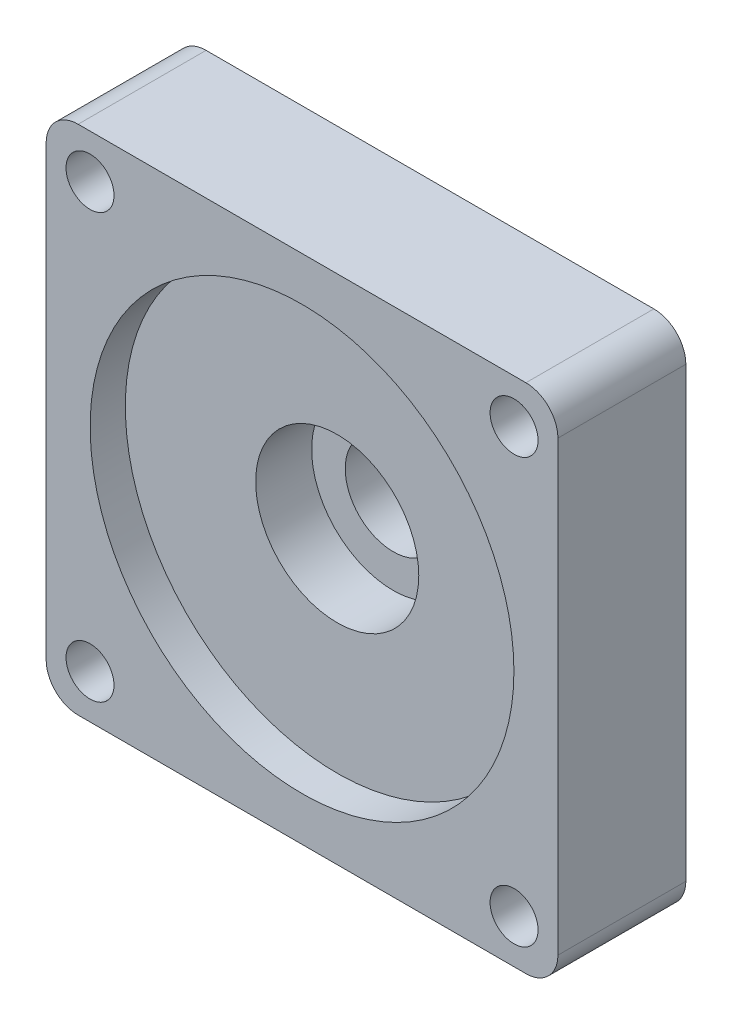
ISO-10303-21;
HEADER;
FILE_DESCRIPTION(('STEP AP214'),'2;1');
FILE_NAME('part.step','',(''),(''),'','','');
FILE_SCHEMA(('AUTOMOTIVE_DESIGN { 1 0 10303 214 1 1 1 1 }'));
ENDSEC;
DATA;
#1=APPLICATION_CONTEXT('core data for automotive mechanical design processes');
#2=APPLICATION_PROTOCOL_DEFINITION('international standard','automotive_design',2000,#1);
#3=PRODUCT_CONTEXT('',#1,'mechanical');
#4=PRODUCT('Part','Part','',(#3));
#5=PRODUCT_RELATED_PRODUCT_CATEGORY('part','',(#4));
#6=PRODUCT_DEFINITION_FORMATION('','',#4);
#7=PRODUCT_DEFINITION_CONTEXT('part definition',#1,'design');
#8=PRODUCT_DEFINITION('design','',#6,#7);
#9=PRODUCT_DEFINITION_SHAPE('','',#8);
#10=(LENGTH_UNIT() NAMED_UNIT(*) SI_UNIT(.MILLI.,.METRE.));
#11=(NAMED_UNIT(*) PLANE_ANGLE_UNIT() SI_UNIT($,.RADIAN.));
#12=(NAMED_UNIT(*) SI_UNIT($,.STERADIAN.) SOLID_ANGLE_UNIT());
#13=UNCERTAINTY_MEASURE_WITH_UNIT(LENGTH_MEASURE(1.E-05),#10,'distance_accuracy_value','');
#14=(GEOMETRIC_REPRESENTATION_CONTEXT(3) GLOBAL_UNCERTAINTY_ASSIGNED_CONTEXT((#13)) GLOBAL_UNIT_ASSIGNED_CONTEXT((#10,
#11,#12)) REPRESENTATION_CONTEXT('',''));
#15=CARTESIAN_POINT('',(0.,0.,0.));
#16=DIRECTION('',(0.,0.,1.));
#17=DIRECTION('',(1.,0.,0.));
#18=AXIS2_PLACEMENT_3D('',#15,#16,#17);
#19=CARTESIAN_POINT('',(16.,16.,8.));
#20=DIRECTION('',(-1.,0.,0.));
#21=DIRECTION('',(0.,0.,1.));
#22=AXIS2_PLACEMENT_3D('',#19,#20,#21);
#23=PLANE('',#22);
#24=DIRECTION('',(0.,1.,0.));
#25=VECTOR('',#24,1.);
#26=CARTESIAN_POINT('',(16.,16.,0.));
#27=LINE('',#26,#25);
#28=CARTESIAN_POINT('',(16.,-14.,0.));
#29=VERTEX_POINT('',#28);
#30=CARTESIAN_POINT('',(16.,14.,0.));
#31=VERTEX_POINT('',#30);
#32=EDGE_CURVE('E165',#29,#31,#27,.T.);
#33=ORIENTED_EDGE('',*,*,#32,.T.);
#34=DIRECTION('',(0.,0.,-1.));
#35=VECTOR('',#34,1.);
#36=CARTESIAN_POINT('',(16.,14.,8.));
#37=LINE('',#36,#35);
#38=CARTESIAN_POINT('',(16.,14.,8.));
#39=VERTEX_POINT('',#38);
#40=EDGE_CURVE('E11',#31,#39,#37,.F.);
#41=ORIENTED_EDGE('',*,*,#40,.T.);
#42=DIRECTION('',(0.,1.,0.));
#43=VECTOR('',#42,1.);
#44=CARTESIAN_POINT('',(16.,16.,8.));
#45=LINE('',#44,#43);
#46=CARTESIAN_POINT('',(16.,-14.,8.));
#47=VERTEX_POINT('',#46);
#48=EDGE_CURVE('E133',#47,#39,#45,.T.);
#49=ORIENTED_EDGE('',*,*,#48,.F.);
#50=DIRECTION('',(0.,0.,-1.));
#51=VECTOR('',#50,1.);
#52=CARTESIAN_POINT('',(16.,-14.,8.));
#53=LINE('',#52,#51);
#54=EDGE_CURVE('E49',#47,#29,#53,.T.);
#55=ORIENTED_EDGE('',*,*,#54,.T.);
#56=EDGE_LOOP('',(#33,#41,#49,#55));
#57=FACE_BOUND('',#56,.T.);
#58=ADVANCED_FACE('F41',(#57),#23,.F.);
#59=CARTESIAN_POINT('',(-16.,16.,8.));
#60=DIRECTION('',(0.,-1.,0.));
#61=DIRECTION('',(0.,0.,-1.));
#62=AXIS2_PLACEMENT_3D('',#59,#60,#61);
#63=PLANE('',#62);
#64=DIRECTION('',(-1.,0.,0.));
#65=VECTOR('',#64,1.);
#66=CARTESIAN_POINT('',(-16.,16.,0.));
#67=LINE('',#66,#65);
#68=CARTESIAN_POINT('',(14.,16.,0.));
#69=VERTEX_POINT('',#68);
#70=CARTESIAN_POINT('',(-14.,16.,0.));
#71=VERTEX_POINT('',#70);
#72=EDGE_CURVE('E138',#69,#71,#67,.T.);
#73=ORIENTED_EDGE('',*,*,#72,.T.);
#74=DIRECTION('',(0.,0.,-1.));
#75=VECTOR('',#74,1.);
#76=CARTESIAN_POINT('',(-14.,16.,8.));
#77=LINE('',#76,#75);
#78=CARTESIAN_POINT('',(-14.,16.,8.));
#79=VERTEX_POINT('',#78);
#80=EDGE_CURVE('E56',#71,#79,#77,.F.);
#81=ORIENTED_EDGE('',*,*,#80,.T.);
#82=DIRECTION('',(-1.,0.,0.));
#83=VECTOR('',#82,1.);
#84=CARTESIAN_POINT('',(-16.,16.,8.));
#85=LINE('',#84,#83);
#86=CARTESIAN_POINT('',(14.,16.,8.));
#87=VERTEX_POINT('',#86);
#88=EDGE_CURVE('E136',#87,#79,#85,.T.);
#89=ORIENTED_EDGE('',*,*,#88,.F.);
#90=DIRECTION('',(0.,0.,-1.));
#91=VECTOR('',#90,1.);
#92=CARTESIAN_POINT('',(14.,16.,8.));
#93=LINE('',#92,#91);
#94=EDGE_CURVE('E157',#87,#69,#93,.T.);
#95=ORIENTED_EDGE('',*,*,#94,.T.);
#96=EDGE_LOOP('',(#73,#81,#89,#95));
#97=FACE_BOUND('',#96,.T.);
#98=ADVANCED_FACE('F266',(#97),#63,.F.);
#99=CARTESIAN_POINT('',(-16.,16.,8.));
#100=DIRECTION('',(1.,0.,0.));
#101=DIRECTION('',(0.,0.,-1.));
#102=AXIS2_PLACEMENT_3D('',#99,#100,#101);
#103=PLANE('',#102);
#104=DIRECTION('',(0.,-1.,0.));
#105=VECTOR('',#104,1.);
#106=CARTESIAN_POINT('',(-16.,16.,0.));
#107=LINE('',#106,#105);
#108=CARTESIAN_POINT('',(-16.,14.,0.));
#109=VERTEX_POINT('',#108);
#110=CARTESIAN_POINT('',(-16.,-14.,0.));
#111=VERTEX_POINT('',#110);
#112=EDGE_CURVE('E134',#109,#111,#107,.T.);
#113=ORIENTED_EDGE('',*,*,#112,.T.);
#114=DIRECTION('',(0.,0.,-1.));
#115=VECTOR('',#114,1.);
#116=CARTESIAN_POINT('',(-16.,-14.,8.));
#117=LINE('',#116,#115);
#118=CARTESIAN_POINT('',(-16.,-14.,8.));
#119=VERTEX_POINT('',#118);
#120=EDGE_CURVE('E112',#111,#119,#117,.F.);
#121=ORIENTED_EDGE('',*,*,#120,.T.);
#122=DIRECTION('',(0.,-1.,0.));
#123=VECTOR('',#122,1.);
#124=CARTESIAN_POINT('',(-16.,16.,8.));
#125=LINE('',#124,#123);
#126=CARTESIAN_POINT('',(-16.,14.,8.));
#127=VERTEX_POINT('',#126);
#128=EDGE_CURVE('E177',#127,#119,#125,.T.);
#129=ORIENTED_EDGE('',*,*,#128,.F.);
#130=DIRECTION('',(0.,0.,-1.));
#131=VECTOR('',#130,1.);
#132=CARTESIAN_POINT('',(-16.,14.,8.));
#133=LINE('',#132,#131);
#134=EDGE_CURVE('E117',#127,#109,#133,.T.);
#135=ORIENTED_EDGE('',*,*,#134,.T.);
#136=EDGE_LOOP('',(#113,#121,#129,#135));
#137=FACE_BOUND('',#136,.T.);
#138=ADVANCED_FACE('F263',(#137),#103,.F.);
#139=CARTESIAN_POINT('',(-16.,-16.,8.));
#140=DIRECTION('',(0.,1.,0.));
#141=DIRECTION('',(0.,0.,1.));
#142=AXIS2_PLACEMENT_3D('',#139,#140,#141);
#143=PLANE('',#142);
#144=DIRECTION('',(1.,0.,0.));
#145=VECTOR('',#144,1.);
#146=CARTESIAN_POINT('',(-16.,-16.,8.));
#147=LINE('',#146,#145);
#148=CARTESIAN_POINT('',(-14.,-16.,8.));
#149=VERTEX_POINT('',#148);
#150=CARTESIAN_POINT('',(14.,-16.,8.));
#151=VERTEX_POINT('',#150);
#152=EDGE_CURVE('E127',#149,#151,#147,.T.);
#153=ORIENTED_EDGE('',*,*,#152,.F.);
#154=DIRECTION('',(0.,0.,-1.));
#155=VECTOR('',#154,1.);
#156=CARTESIAN_POINT('',(-14.,-16.,8.));
#157=LINE('',#156,#155);
#158=CARTESIAN_POINT('',(-14.,-16.,0.));
#159=VERTEX_POINT('',#158);
#160=EDGE_CURVE('E111',#149,#159,#157,.T.);
#161=ORIENTED_EDGE('',*,*,#160,.T.);
#162=DIRECTION('',(1.,0.,0.));
#163=VECTOR('',#162,1.);
#164=CARTESIAN_POINT('',(-16.,-16.,0.));
#165=LINE('',#164,#163);
#166=CARTESIAN_POINT('',(14.,-16.,0.));
#167=VERTEX_POINT('',#166);
#168=EDGE_CURVE('E124',#159,#167,#165,.T.);
#169=ORIENTED_EDGE('',*,*,#168,.T.);
#170=DIRECTION('',(0.,0.,-1.));
#171=VECTOR('',#170,1.);
#172=CARTESIAN_POINT('',(14.,-16.,8.));
#173=LINE('',#172,#171);
#174=EDGE_CURVE('E129',#167,#151,#173,.F.);
#175=ORIENTED_EDGE('',*,*,#174,.T.);
#176=EDGE_LOOP('',(#153,#161,#169,#175));
#177=FACE_BOUND('',#176,.T.);
#178=ADVANCED_FACE('F123',(#177),#143,.F.);
#179=CARTESIAN_POINT('',(0.,0.,8.));
#180=DIRECTION('',(0.,0.,1.));
#181=DIRECTION('',(1.,0.,0.));
#182=AXIS2_PLACEMENT_3D('',#179,#180,#181);
#183=PLANE('',#182);
#184=CARTESIAN_POINT('',(0.,0.,8.));
#185=DIRECTION('',(0.,0.,1.));
#186=DIRECTION('',(1.,0.,0.));
#187=AXIS2_PLACEMENT_3D('',#184,#185,#186);
#188=CIRCLE('',#187,13.25);
#189=CARTESIAN_POINT('',(13.25,0.,8.));
#190=VERTEX_POINT('',#189);
#191=EDGE_CURVE('E202',#190,#190,#188,.T.);
#192=ORIENTED_EDGE('',*,*,#191,.F.);
#193=EDGE_LOOP('',(#192));
#194=FACE_BOUND('',#193,.T.);
#195=CARTESIAN_POINT('',(-13.2582521472478,-13.2582521472478,8.));
#196=DIRECTION('',(0.,0.,1.));
#197=DIRECTION('',(1.,0.,0.));
#198=AXIS2_PLACEMENT_3D('',#195,#196,#197);
#199=CIRCLE('',#198,1.5);
#200=CARTESIAN_POINT('',(-11.7582521472478,-13.2582521472478,8.));
#201=VERTEX_POINT('',#200);
#202=EDGE_CURVE('E184',#201,#201,#199,.T.);
#203=ORIENTED_EDGE('',*,*,#202,.F.);
#204=EDGE_LOOP('',(#203));
#205=FACE_BOUND('',#204,.T.);
#206=CARTESIAN_POINT('',(13.2582521472478,-13.2582521472478,8.));
#207=DIRECTION('',(0.,0.,1.));
#208=DIRECTION('',(1.,0.,0.));
#209=AXIS2_PLACEMENT_3D('',#206,#207,#208);
#210=CIRCLE('',#209,1.5);
#211=CARTESIAN_POINT('',(14.7582521472478,-13.2582521472478,8.));
#212=VERTEX_POINT('',#211);
#213=EDGE_CURVE('E192',#212,#212,#210,.T.);
#214=ORIENTED_EDGE('',*,*,#213,.F.);
#215=EDGE_LOOP('',(#214));
#216=FACE_BOUND('',#215,.T.);
#217=CARTESIAN_POINT('',(13.2582521472478,13.2582521472478,8.));
#218=DIRECTION('',(0.,0.,1.));
#219=DIRECTION('',(1.,0.,0.));
#220=AXIS2_PLACEMENT_3D('',#217,#218,#219);
#221=CIRCLE('',#220,1.5);
#222=CARTESIAN_POINT('',(14.7582521472478,13.2582521472478,8.));
#223=VERTEX_POINT('',#222);
#224=EDGE_CURVE('E183',#223,#223,#221,.T.);
#225=ORIENTED_EDGE('',*,*,#224,.F.);
#226=EDGE_LOOP('',(#225));
#227=FACE_BOUND('',#226,.T.);
#228=CARTESIAN_POINT('',(-13.2582521472478,13.2582521472478,8.));
#229=DIRECTION('',(0.,0.,1.));
#230=DIRECTION('',(1.,0.,0.));
#231=AXIS2_PLACEMENT_3D('',#228,#229,#230);
#232=CIRCLE('',#231,1.5);
#233=CARTESIAN_POINT('',(-11.7582521472478,13.2582521472478,8.));
#234=VERTEX_POINT('',#233);
#235=EDGE_CURVE('E173',#234,#234,#232,.T.);
#236=ORIENTED_EDGE('',*,*,#235,.F.);
#237=EDGE_LOOP('',(#236));
#238=FACE_BOUND('',#237,.T.);
#239=ORIENTED_EDGE('',*,*,#128,.T.);
#240=CARTESIAN_POINT('',(-14.,-14.,8.));
#241=DIRECTION('',(0.,0.,1.));
#242=DIRECTION('',(1.,0.,0.));
#243=AXIS2_PLACEMENT_3D('',#240,#241,#242);
#244=CIRCLE('',#243,2.);
#245=EDGE_CURVE('E155',#119,#149,#244,.T.);
#246=ORIENTED_EDGE('',*,*,#245,.T.);
#247=ORIENTED_EDGE('',*,*,#152,.T.);
#248=CARTESIAN_POINT('',(14.,-14.,8.));
#249=DIRECTION('',(0.,0.,1.));
#250=DIRECTION('',(1.,0.,0.));
#251=AXIS2_PLACEMENT_3D('',#248,#249,#250);
#252=CIRCLE('',#251,2.);
#253=EDGE_CURVE('E150',#151,#47,#252,.T.);
#254=ORIENTED_EDGE('',*,*,#253,.T.);
#255=ORIENTED_EDGE('',*,*,#48,.T.);
#256=CARTESIAN_POINT('',(14.,14.,8.));
#257=DIRECTION('',(0.,0.,1.));
#258=DIRECTION('',(1.,0.,0.));
#259=AXIS2_PLACEMENT_3D('',#256,#257,#258);
#260=CIRCLE('',#259,2.);
#261=EDGE_CURVE('E63',#39,#87,#260,.T.);
#262=ORIENTED_EDGE('',*,*,#261,.T.);
#263=ORIENTED_EDGE('',*,*,#88,.T.);
#264=CARTESIAN_POINT('',(-14.,14.,8.));
#265=DIRECTION('',(0.,0.,1.));
#266=DIRECTION('',(1.,0.,0.));
#267=AXIS2_PLACEMENT_3D('',#264,#265,#266);
#268=CIRCLE('',#267,2.);
#269=EDGE_CURVE('E153',#79,#127,#268,.T.);
#270=ORIENTED_EDGE('',*,*,#269,.T.);
#271=EDGE_LOOP('',(#239,#246,#247,#254,#255,#262,#263,#270));
#272=FACE_BOUND('',#271,.T.);
#273=ADVANCED_FACE('F248',(#194,#205,#216,#227,#238,#272),#183,.T.);
#274=CARTESIAN_POINT('',(0.,0.,0.));
#275=DIRECTION('',(0.,0.,1.));
#276=DIRECTION('',(1.,0.,0.));
#277=AXIS2_PLACEMENT_3D('',#274,#275,#276);
#278=PLANE('',#277);
#279=CARTESIAN_POINT('',(0.,0.,0.));
#280=DIRECTION('',(0.,0.,1.));
#281=DIRECTION('',(1.,0.,0.));
#282=AXIS2_PLACEMENT_3D('',#279,#280,#281);
#283=CIRCLE('',#282,3.);
#284=CARTESIAN_POINT('',(3.,0.,0.));
#285=VERTEX_POINT('',#284);
#286=EDGE_CURVE('E211',#285,#285,#283,.F.);
#287=ORIENTED_EDGE('',*,*,#286,.F.);
#288=EDGE_LOOP('',(#287));
#289=FACE_BOUND('',#288,.T.);
#290=CARTESIAN_POINT('',(-13.2582521472478,-13.2582521472478,0.));
#291=DIRECTION('',(0.,0.,1.));
#292=DIRECTION('',(1.,0.,0.));
#293=AXIS2_PLACEMENT_3D('',#290,#291,#292);
#294=CIRCLE('',#293,1.5);
#295=CARTESIAN_POINT('',(-11.7582521472478,-13.2582521472478,0.));
#296=VERTEX_POINT('',#295);
#297=EDGE_CURVE('E188',#296,#296,#294,.F.);
#298=ORIENTED_EDGE('',*,*,#297,.F.);
#299=EDGE_LOOP('',(#298));
#300=FACE_BOUND('',#299,.T.);
#301=CARTESIAN_POINT('',(13.2582521472478,-13.2582521472478,0.));
#302=DIRECTION('',(0.,0.,1.));
#303=DIRECTION('',(1.,0.,0.));
#304=AXIS2_PLACEMENT_3D('',#301,#302,#303);
#305=CIRCLE('',#304,1.5);
#306=CARTESIAN_POINT('',(14.7582521472478,-13.2582521472478,0.));
#307=VERTEX_POINT('',#306);
#308=EDGE_CURVE('E187',#307,#307,#305,.F.);
#309=ORIENTED_EDGE('',*,*,#308,.F.);
#310=EDGE_LOOP('',(#309));
#311=FACE_BOUND('',#310,.T.);
#312=CARTESIAN_POINT('',(13.2582521472478,13.2582521472478,0.));
#313=DIRECTION('',(0.,0.,1.));
#314=DIRECTION('',(1.,0.,0.));
#315=AXIS2_PLACEMENT_3D('',#312,#313,#314);
#316=CIRCLE('',#315,1.5);
#317=CARTESIAN_POINT('',(14.7582521472478,13.2582521472478,0.));
#318=VERTEX_POINT('',#317);
#319=EDGE_CURVE('E195',#318,#318,#316,.F.);
#320=ORIENTED_EDGE('',*,*,#319,.F.);
#321=EDGE_LOOP('',(#320));
#322=FACE_BOUND('',#321,.T.);
#323=CARTESIAN_POINT('',(-13.2582521472478,13.2582521472478,0.));
#324=DIRECTION('',(0.,0.,1.));
#325=DIRECTION('',(1.,0.,0.));
#326=AXIS2_PLACEMENT_3D('',#323,#324,#325);
#327=CIRCLE('',#326,1.5);
#328=CARTESIAN_POINT('',(-11.7582521472478,13.2582521472478,0.));
#329=VERTEX_POINT('',#328);
#330=EDGE_CURVE('E170',#329,#329,#327,.F.);
#331=ORIENTED_EDGE('',*,*,#330,.F.);
#332=EDGE_LOOP('',(#331));
#333=FACE_BOUND('',#332,.T.);
#334=ORIENTED_EDGE('',*,*,#168,.F.);
#335=CARTESIAN_POINT('',(-14.,-14.,0.));
#336=DIRECTION('',(0.,0.,1.));
#337=DIRECTION('',(1.,0.,0.));
#338=AXIS2_PLACEMENT_3D('',#335,#336,#337);
#339=CIRCLE('',#338,2.);
#340=EDGE_CURVE('E107',#159,#111,#339,.F.);
#341=ORIENTED_EDGE('',*,*,#340,.T.);
#342=ORIENTED_EDGE('',*,*,#112,.F.);
#343=CARTESIAN_POINT('',(-14.,14.,0.));
#344=DIRECTION('',(0.,0.,1.));
#345=DIRECTION('',(1.,0.,0.));
#346=AXIS2_PLACEMENT_3D('',#343,#344,#345);
#347=CIRCLE('',#346,2.);
#348=EDGE_CURVE('E118',#109,#71,#347,.F.);
#349=ORIENTED_EDGE('',*,*,#348,.T.);
#350=ORIENTED_EDGE('',*,*,#72,.F.);
#351=CARTESIAN_POINT('',(14.,14.,0.));
#352=DIRECTION('',(0.,0.,1.));
#353=DIRECTION('',(1.,0.,0.));
#354=AXIS2_PLACEMENT_3D('',#351,#352,#353);
#355=CIRCLE('',#354,2.);
#356=EDGE_CURVE('E144',#69,#31,#355,.F.);
#357=ORIENTED_EDGE('',*,*,#356,.T.);
#358=ORIENTED_EDGE('',*,*,#32,.F.);
#359=CARTESIAN_POINT('',(14.,-14.,0.));
#360=DIRECTION('',(0.,0.,1.));
#361=DIRECTION('',(1.,0.,0.));
#362=AXIS2_PLACEMENT_3D('',#359,#360,#361);
#363=CIRCLE('',#362,2.);
#364=EDGE_CURVE('E128',#29,#167,#363,.F.);
#365=ORIENTED_EDGE('',*,*,#364,.T.);
#366=EDGE_LOOP('',(#334,#341,#342,#349,#350,#357,#358,#365));
#367=FACE_BOUND('',#366,.T.);
#368=ADVANCED_FACE('F131',(#289,#300,#311,#322,#333,#367),#278,.F.);
#369=CARTESIAN_POINT('',(-13.2582521472478,13.2582521472478,-0.000999999999999265));
#370=DIRECTION('',(0.,0.,1.));
#371=DIRECTION('',(1.,0.,0.));
#372=AXIS2_PLACEMENT_3D('',#369,#370,#371);
#373=CYLINDRICAL_SURFACE('',#372,1.5);
#374=ORIENTED_EDGE('',*,*,#235,.T.);
#375=EDGE_LOOP('',(#374));
#376=FACE_BOUND('',#375,.T.);
#377=ORIENTED_EDGE('',*,*,#330,.T.);
#378=EDGE_LOOP('',(#377));
#379=FACE_BOUND('',#378,.T.);
#380=ADVANCED_FACE('F371',(#376,#379),#373,.F.);
#381=CARTESIAN_POINT('',(13.2582521472478,13.2582521472478,-0.000999999999999265));
#382=DIRECTION('',(0.,0.,1.));
#383=DIRECTION('',(1.,0.,0.));
#384=AXIS2_PLACEMENT_3D('',#381,#382,#383);
#385=CYLINDRICAL_SURFACE('',#384,1.5);
#386=ORIENTED_EDGE('',*,*,#224,.T.);
#387=EDGE_LOOP('',(#386));
#388=FACE_BOUND('',#387,.T.);
#389=ORIENTED_EDGE('',*,*,#319,.T.);
#390=EDGE_LOOP('',(#389));
#391=FACE_BOUND('',#390,.T.);
#392=ADVANCED_FACE('F361',(#388,#391),#385,.F.);
#393=CARTESIAN_POINT('',(13.2582521472478,-13.2582521472478,-0.000999999999999265));
#394=DIRECTION('',(0.,0.,1.));
#395=DIRECTION('',(1.,0.,0.));
#396=AXIS2_PLACEMENT_3D('',#393,#394,#395);
#397=CYLINDRICAL_SURFACE('',#396,1.5);
#398=ORIENTED_EDGE('',*,*,#213,.T.);
#399=EDGE_LOOP('',(#398));
#400=FACE_BOUND('',#399,.T.);
#401=ORIENTED_EDGE('',*,*,#308,.T.);
#402=EDGE_LOOP('',(#401));
#403=FACE_BOUND('',#402,.T.);
#404=ADVANCED_FACE('F351',(#400,#403),#397,.F.);
#405=CARTESIAN_POINT('',(-13.2582521472478,-13.2582521472478,-0.000999999999999265));
#406=DIRECTION('',(0.,0.,1.));
#407=DIRECTION('',(1.,0.,0.));
#408=AXIS2_PLACEMENT_3D('',#405,#406,#407);
#409=CYLINDRICAL_SURFACE('',#408,1.5);
#410=ORIENTED_EDGE('',*,*,#202,.T.);
#411=EDGE_LOOP('',(#410));
#412=FACE_BOUND('',#411,.T.);
#413=ORIENTED_EDGE('',*,*,#297,.T.);
#414=EDGE_LOOP('',(#413));
#415=FACE_BOUND('',#414,.T.);
#416=ADVANCED_FACE('F244',(#412,#415),#409,.F.);
#417=CARTESIAN_POINT('',(0.,0.,5.8));
#418=DIRECTION('',(0.,0.,1.));
#419=DIRECTION('',(1.,0.,0.));
#420=AXIS2_PLACEMENT_3D('',#417,#418,#419);
#421=CYLINDRICAL_SURFACE('',#420,13.25);
#422=CARTESIAN_POINT('',(0.,0.,5.8));
#423=DIRECTION('',(0.,0.,1.));
#424=DIRECTION('',(1.,0.,0.));
#425=AXIS2_PLACEMENT_3D('',#422,#423,#424);
#426=CIRCLE('',#425,13.25);
#427=CARTESIAN_POINT('',(13.25,0.,5.8));
#428=VERTEX_POINT('',#427);
#429=EDGE_CURVE('E191',#428,#428,#426,.T.);
#430=ORIENTED_EDGE('',*,*,#429,.F.);
#431=EDGE_LOOP('',(#430));
#432=FACE_BOUND('',#431,.T.);
#433=ORIENTED_EDGE('',*,*,#191,.T.);
#434=EDGE_LOOP('',(#433));
#435=FACE_BOUND('',#434,.T.);
#436=ADVANCED_FACE('F238',(#432,#435),#421,.F.);
#437=CARTESIAN_POINT('',(0.,0.,5.8));
#438=DIRECTION('',(0.,0.,1.));
#439=DIRECTION('',(1.,0.,0.));
#440=AXIS2_PLACEMENT_3D('',#437,#438,#439);
#441=PLANE('',#440);
#442=CARTESIAN_POINT('',(0.,0.,5.8));
#443=DIRECTION('',(0.,0.,1.));
#444=DIRECTION('',(1.,0.,0.));
#445=AXIS2_PLACEMENT_3D('',#442,#443,#444);
#446=CIRCLE('',#445,5.1);
#447=CARTESIAN_POINT('',(5.1,0.,5.8));
#448=VERTEX_POINT('',#447);
#449=EDGE_CURVE('E208',#448,#448,#446,.T.);
#450=ORIENTED_EDGE('',*,*,#449,.F.);
#451=EDGE_LOOP('',(#450));
#452=FACE_BOUND('',#451,.T.);
#453=ORIENTED_EDGE('',*,*,#429,.T.);
#454=EDGE_LOOP('',(#453));
#455=FACE_BOUND('',#454,.T.);
#456=ADVANCED_FACE('F232',(#452,#455),#441,.T.);
#457=CARTESIAN_POINT('',(0.,0.,2.3));
#458=DIRECTION('',(0.,0.,1.));
#459=DIRECTION('',(1.,0.,0.));
#460=AXIS2_PLACEMENT_3D('',#457,#458,#459);
#461=CYLINDRICAL_SURFACE('',#460,5.1);
#462=CARTESIAN_POINT('',(0.,0.,2.3));
#463=DIRECTION('',(0.,0.,1.));
#464=DIRECTION('',(1.,0.,0.));
#465=AXIS2_PLACEMENT_3D('',#462,#463,#464);
#466=CIRCLE('',#465,5.1);
#467=CARTESIAN_POINT('',(5.1,0.,2.3));
#468=VERTEX_POINT('',#467);
#469=EDGE_CURVE('E205',#468,#468,#466,.T.);
#470=ORIENTED_EDGE('',*,*,#469,.F.);
#471=EDGE_LOOP('',(#470));
#472=FACE_BOUND('',#471,.T.);
#473=ORIENTED_EDGE('',*,*,#449,.T.);
#474=EDGE_LOOP('',(#473));
#475=FACE_BOUND('',#474,.T.);
#476=ADVANCED_FACE('F226',(#472,#475),#461,.F.);
#477=CARTESIAN_POINT('',(0.,0.,2.3));
#478=DIRECTION('',(0.,0.,1.));
#479=DIRECTION('',(1.,0.,0.));
#480=AXIS2_PLACEMENT_3D('',#477,#478,#479);
#481=PLANE('',#480);
#482=CARTESIAN_POINT('',(0.,0.,2.3));
#483=DIRECTION('',(0.,0.,1.));
#484=DIRECTION('',(1.,0.,0.));
#485=AXIS2_PLACEMENT_3D('',#482,#483,#484);
#486=CIRCLE('',#485,3.);
#487=CARTESIAN_POINT('',(3.,0.,2.3));
#488=VERTEX_POINT('',#487);
#489=EDGE_CURVE('E216',#488,#488,#486,.T.);
#490=ORIENTED_EDGE('',*,*,#489,.F.);
#491=EDGE_LOOP('',(#490));
#492=FACE_BOUND('',#491,.T.);
#493=ORIENTED_EDGE('',*,*,#469,.T.);
#494=EDGE_LOOP('',(#493));
#495=FACE_BOUND('',#494,.T.);
#496=ADVANCED_FACE('F223',(#492,#495),#481,.T.);
#497=CARTESIAN_POINT('',(0.,0.,-0.00100000000000013));
#498=DIRECTION('',(0.,0.,1.));
#499=DIRECTION('',(1.,0.,0.));
#500=AXIS2_PLACEMENT_3D('',#497,#498,#499);
#501=CYLINDRICAL_SURFACE('',#500,3.);
#502=ORIENTED_EDGE('',*,*,#489,.T.);
#503=EDGE_LOOP('',(#502));
#504=FACE_BOUND('',#503,.T.);
#505=ORIENTED_EDGE('',*,*,#286,.T.);
#506=EDGE_LOOP('',(#505));
#507=FACE_BOUND('',#506,.T.);
#508=ADVANCED_FACE('F220',(#504,#507),#501,.F.);
#509=CARTESIAN_POINT('',(-14.,-14.,8.));
#510=DIRECTION('',(0.,0.,-1.));
#511=DIRECTION('',(-1.,0.,0.));
#512=AXIS2_PLACEMENT_3D('',#509,#510,#511);
#513=CYLINDRICAL_SURFACE('',#512,2.);
#514=ORIENTED_EDGE('',*,*,#245,.F.);
#515=ORIENTED_EDGE('',*,*,#120,.F.);
#516=ORIENTED_EDGE('',*,*,#340,.F.);
#517=ORIENTED_EDGE('',*,*,#160,.F.);
#518=EDGE_LOOP('',(#514,#515,#516,#517));
#519=FACE_BOUND('',#518,.T.);
#520=ADVANCED_FACE('F110',(#519),#513,.T.);
#521=CARTESIAN_POINT('',(-14.,14.,8.));
#522=DIRECTION('',(0.,0.,-1.));
#523=DIRECTION('',(-1.,0.,0.));
#524=AXIS2_PLACEMENT_3D('',#521,#522,#523);
#525=CYLINDRICAL_SURFACE('',#524,2.);
#526=ORIENTED_EDGE('',*,*,#269,.F.);
#527=ORIENTED_EDGE('',*,*,#80,.F.);
#528=ORIENTED_EDGE('',*,*,#348,.F.);
#529=ORIENTED_EDGE('',*,*,#134,.F.);
#530=EDGE_LOOP('',(#526,#527,#528,#529));
#531=FACE_BOUND('',#530,.T.);
#532=ADVANCED_FACE('F265',(#531),#525,.T.);
#533=CARTESIAN_POINT('',(14.,14.,8.));
#534=DIRECTION('',(0.,0.,-1.));
#535=DIRECTION('',(-1.,0.,0.));
#536=AXIS2_PLACEMENT_3D('',#533,#534,#535);
#537=CYLINDRICAL_SURFACE('',#536,2.);
#538=ORIENTED_EDGE('',*,*,#261,.F.);
#539=ORIENTED_EDGE('',*,*,#40,.F.);
#540=ORIENTED_EDGE('',*,*,#356,.F.);
#541=ORIENTED_EDGE('',*,*,#94,.F.);
#542=EDGE_LOOP('',(#538,#539,#540,#541));
#543=FACE_BOUND('',#542,.T.);
#544=ADVANCED_FACE('F269',(#543),#537,.T.);
#545=CARTESIAN_POINT('',(14.,-14.,8.));
#546=DIRECTION('',(0.,0.,-1.));
#547=DIRECTION('',(-1.,0.,0.));
#548=AXIS2_PLACEMENT_3D('',#545,#546,#547);
#549=CYLINDRICAL_SURFACE('',#548,2.);
#550=ORIENTED_EDGE('',*,*,#253,.F.);
#551=ORIENTED_EDGE('',*,*,#174,.F.);
#552=ORIENTED_EDGE('',*,*,#364,.F.);
#553=ORIENTED_EDGE('',*,*,#54,.F.);
#554=EDGE_LOOP('',(#550,#551,#552,#553));
#555=FACE_BOUND('',#554,.T.);
#556=ADVANCED_FACE('F43',(#555),#549,.T.);
#557=CLOSED_SHELL('',(#58,#98,#138,#178,#273,#368,#380,#392,#404,#416,#436,#456,#476,#496,#508,
#520,#532,#544,#556));
#558=MANIFOLD_SOLID_BREP('B2',#557);
#559=ADVANCED_BREP_SHAPE_REPRESENTATION('',(#18,#558),#14);
#560=SHAPE_DEFINITION_REPRESENTATION(#9,#559);
ENDSEC;
END-ISO-10303-21;
